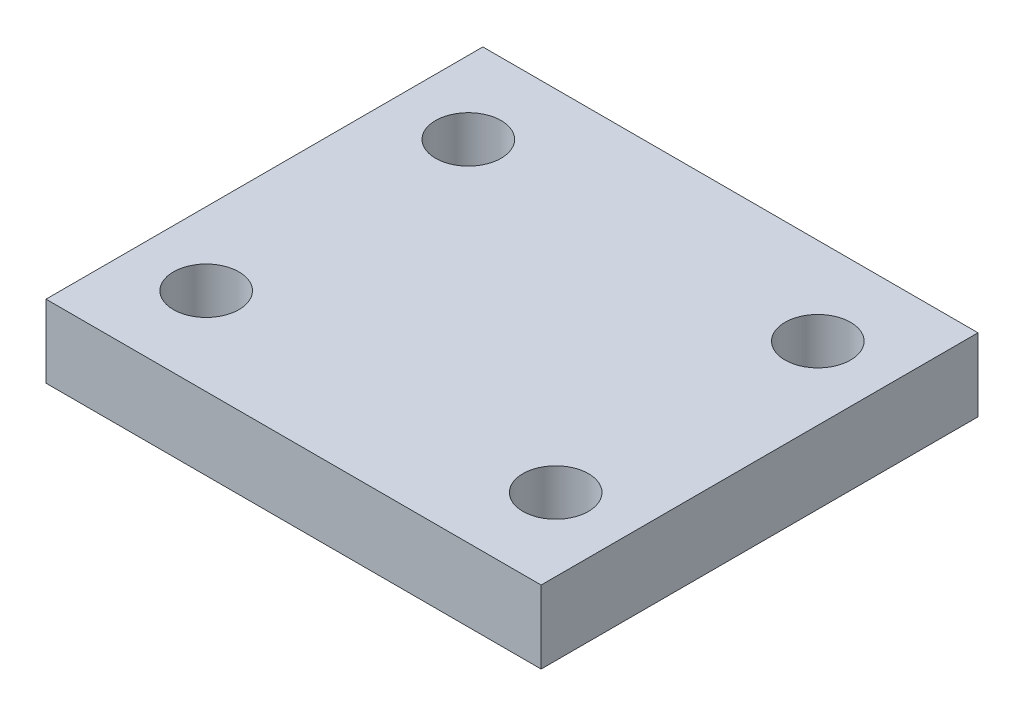
ISO-10303-21;
HEADER;
FILE_DESCRIPTION(('STEP AP214'),'2;1');
FILE_NAME('part.step','',(''),(''),'','','');
FILE_SCHEMA(('AUTOMOTIVE_DESIGN { 1 0 10303 214 1 1 1 1 }'));
ENDSEC;
DATA;
#1=APPLICATION_CONTEXT('core data for automotive mechanical design processes');
#2=APPLICATION_PROTOCOL_DEFINITION('international standard','automotive_design',2000,#1);
#3=PRODUCT_CONTEXT('',#1,'mechanical');
#4=PRODUCT('Part','Part','',(#3));
#5=PRODUCT_RELATED_PRODUCT_CATEGORY('part','',(#4));
#6=PRODUCT_DEFINITION_FORMATION('','',#4);
#7=PRODUCT_DEFINITION_CONTEXT('part definition',#1,'design');
#8=PRODUCT_DEFINITION('design','',#6,#7);
#9=PRODUCT_DEFINITION_SHAPE('','',#8);
#10=(LENGTH_UNIT() NAMED_UNIT(*) SI_UNIT(.MILLI.,.METRE.));
#11=(NAMED_UNIT(*) PLANE_ANGLE_UNIT() SI_UNIT($,.RADIAN.));
#12=(NAMED_UNIT(*) SI_UNIT($,.STERADIAN.) SOLID_ANGLE_UNIT());
#13=UNCERTAINTY_MEASURE_WITH_UNIT(LENGTH_MEASURE(1.E-05),#10,'distance_accuracy_value','');
#14=(GEOMETRIC_REPRESENTATION_CONTEXT(3) GLOBAL_UNCERTAINTY_ASSIGNED_CONTEXT((#13)) GLOBAL_UNIT_ASSIGNED_CONTEXT((#10,
#11,#12)) REPRESENTATION_CONTEXT('',''));
#15=CARTESIAN_POINT('',(0.,0.,0.));
#16=DIRECTION('',(0.,0.,1.));
#17=DIRECTION('',(1.,0.,0.));
#18=AXIS2_PLACEMENT_3D('',#15,#16,#17);
#19=CARTESIAN_POINT('',(0.,5.,0.));
#20=DIRECTION('',(0.,-1.,0.));
#21=DIRECTION('',(0.,0.,-1.));
#22=AXIS2_PLACEMENT_3D('',#19,#20,#21);
#23=PLANE('',#22);
#24=CARTESIAN_POINT('',(29.,5.,-24.));
#25=DIRECTION('',(0.,1.,0.));
#26=DIRECTION('',(0.,0.,1.));
#27=AXIS2_PLACEMENT_3D('',#24,#25,#26);
#28=CIRCLE('',#27,2.25);
#29=CARTESIAN_POINT('',(29.,5.,-21.75));
#30=VERTEX_POINT('',#29);
#31=EDGE_CURVE('E121',#30,#30,#28,.T.);
#32=ORIENTED_EDGE('',*,*,#31,.F.);
#33=EDGE_LOOP('',(#32));
#34=FACE_BOUND('',#33,.T.);
#35=CARTESIAN_POINT('',(5.,5.,-6.));
#36=DIRECTION('',(0.,1.,0.));
#37=DIRECTION('',(0.,0.,1.));
#38=AXIS2_PLACEMENT_3D('',#35,#36,#37);
#39=CIRCLE('',#38,2.25);
#40=CARTESIAN_POINT('',(5.,5.,-3.75));
#41=VERTEX_POINT('',#40);
#42=EDGE_CURVE('E100',#41,#41,#39,.T.);
#43=ORIENTED_EDGE('',*,*,#42,.F.);
#44=EDGE_LOOP('',(#43));
#45=FACE_BOUND('',#44,.T.);
#46=DIRECTION('',(0.,0.,1.));
#47=VECTOR('',#46,1.);
#48=CARTESIAN_POINT('',(0.,5.,0.));
#49=LINE('',#48,#47);
#50=CARTESIAN_POINT('',(0.,5.,-30.));
#51=VERTEX_POINT('',#50);
#52=CARTESIAN_POINT('',(0.,5.,0.));
#53=VERTEX_POINT('',#52);
#54=EDGE_CURVE('E85',#51,#53,#49,.T.);
#55=ORIENTED_EDGE('',*,*,#54,.T.);
#56=DIRECTION('',(1.,0.,0.));
#57=VECTOR('',#56,1.);
#58=CARTESIAN_POINT('',(0.,5.,0.));
#59=LINE('',#58,#57);
#60=CARTESIAN_POINT('',(34.,5.,0.));
#61=VERTEX_POINT('',#60);
#62=EDGE_CURVE('E80',#53,#61,#59,.T.);
#63=ORIENTED_EDGE('',*,*,#62,.T.);
#64=DIRECTION('',(0.,0.,-1.));
#65=VECTOR('',#64,1.);
#66=CARTESIAN_POINT('',(34.,5.,0.));
#67=LINE('',#66,#65);
#68=CARTESIAN_POINT('',(34.,5.,-30.));
#69=VERTEX_POINT('',#68);
#70=EDGE_CURVE('E83',#61,#69,#67,.T.);
#71=ORIENTED_EDGE('',*,*,#70,.T.);
#72=DIRECTION('',(-1.,0.,0.));
#73=VECTOR('',#72,1.);
#74=CARTESIAN_POINT('',(0.,5.,-30.));
#75=LINE('',#74,#73);
#76=EDGE_CURVE('E50',#69,#51,#75,.T.);
#77=ORIENTED_EDGE('',*,*,#76,.T.);
#78=EDGE_LOOP('',(#55,#63,#71,#77));
#79=FACE_BOUND('',#78,.T.);
#80=CARTESIAN_POINT('',(29.,5.,-6.));
#81=DIRECTION('',(0.,1.,0.));
#82=DIRECTION('',(0.,0.,1.));
#83=AXIS2_PLACEMENT_3D('',#80,#81,#82);
#84=CIRCLE('',#83,2.25);
#85=CARTESIAN_POINT('',(29.,5.,-3.75));
#86=VERTEX_POINT('',#85);
#87=EDGE_CURVE('E115',#86,#86,#84,.T.);
#88=ORIENTED_EDGE('',*,*,#87,.F.);
#89=EDGE_LOOP('',(#88));
#90=FACE_BOUND('',#89,.T.);
#91=CARTESIAN_POINT('',(5.,5.,-24.));
#92=DIRECTION('',(0.,1.,0.));
#93=DIRECTION('',(0.,0.,1.));
#94=AXIS2_PLACEMENT_3D('',#91,#92,#93);
#95=CIRCLE('',#94,2.25);
#96=CARTESIAN_POINT('',(5.,5.,-21.75));
#97=VERTEX_POINT('',#96);
#98=EDGE_CURVE('E127',#97,#97,#95,.T.);
#99=ORIENTED_EDGE('',*,*,#98,.F.);
#100=EDGE_LOOP('',(#99));
#101=FACE_BOUND('',#100,.T.);
#102=ADVANCED_FACE('F33',(#34,#45,#79,#90,#101),#23,.F.);
#103=CARTESIAN_POINT('',(0.,0.,0.));
#104=DIRECTION('',(0.,-1.,0.));
#105=DIRECTION('',(0.,0.,-1.));
#106=AXIS2_PLACEMENT_3D('',#103,#104,#105);
#107=PLANE('',#106);
#108=CARTESIAN_POINT('',(29.,0.,-24.));
#109=DIRECTION('',(0.,1.,0.));
#110=DIRECTION('',(0.,0.,1.));
#111=AXIS2_PLACEMENT_3D('',#108,#109,#110);
#112=CIRCLE('',#111,2.25);
#113=CARTESIAN_POINT('',(29.,0.,-21.75));
#114=VERTEX_POINT('',#113);
#115=EDGE_CURVE('E124',#114,#114,#112,.T.);
#116=ORIENTED_EDGE('',*,*,#115,.T.);
#117=EDGE_LOOP('',(#116));
#118=FACE_BOUND('',#117,.T.);
#119=CARTESIAN_POINT('',(5.,0.,-6.));
#120=DIRECTION('',(0.,1.,0.));
#121=DIRECTION('',(0.,0.,1.));
#122=AXIS2_PLACEMENT_3D('',#119,#120,#121);
#123=CIRCLE('',#122,2.25);
#124=CARTESIAN_POINT('',(5.,0.,-3.75));
#125=VERTEX_POINT('',#124);
#126=EDGE_CURVE('E112',#125,#125,#123,.T.);
#127=ORIENTED_EDGE('',*,*,#126,.T.);
#128=EDGE_LOOP('',(#127));
#129=FACE_BOUND('',#128,.T.);
#130=DIRECTION('',(0.,0.,1.));
#131=VECTOR('',#130,1.);
#132=CARTESIAN_POINT('',(0.,0.,0.));
#133=LINE('',#132,#131);
#134=CARTESIAN_POINT('',(0.,0.,-30.));
#135=VERTEX_POINT('',#134);
#136=CARTESIAN_POINT('',(0.,0.,0.));
#137=VERTEX_POINT('',#136);
#138=EDGE_CURVE('E97',#135,#137,#133,.T.);
#139=ORIENTED_EDGE('',*,*,#138,.F.);
#140=DIRECTION('',(-1.,0.,0.));
#141=VECTOR('',#140,1.);
#142=CARTESIAN_POINT('',(0.,0.,-30.));
#143=LINE('',#142,#141);
#144=CARTESIAN_POINT('',(34.,0.,-30.));
#145=VERTEX_POINT('',#144);
#146=EDGE_CURVE('E73',#145,#135,#143,.T.);
#147=ORIENTED_EDGE('',*,*,#146,.F.);
#148=DIRECTION('',(0.,0.,-1.));
#149=VECTOR('',#148,1.);
#150=CARTESIAN_POINT('',(34.,0.,0.));
#151=LINE('',#150,#149);
#152=CARTESIAN_POINT('',(34.,0.,0.));
#153=VERTEX_POINT('',#152);
#154=EDGE_CURVE('E67',#153,#145,#151,.T.);
#155=ORIENTED_EDGE('',*,*,#154,.F.);
#156=DIRECTION('',(1.,0.,0.));
#157=VECTOR('',#156,1.);
#158=CARTESIAN_POINT('',(0.,0.,0.));
#159=LINE('',#158,#157);
#160=EDGE_CURVE('E89',#137,#153,#159,.T.);
#161=ORIENTED_EDGE('',*,*,#160,.F.);
#162=EDGE_LOOP('',(#139,#147,#155,#161));
#163=FACE_BOUND('',#162,.T.);
#164=CARTESIAN_POINT('',(29.,0.,-6.));
#165=DIRECTION('',(0.,1.,0.));
#166=DIRECTION('',(0.,0.,1.));
#167=AXIS2_PLACEMENT_3D('',#164,#165,#166);
#168=CIRCLE('',#167,2.25);
#169=CARTESIAN_POINT('',(29.,0.,-3.75));
#170=VERTEX_POINT('',#169);
#171=EDGE_CURVE('E118',#170,#170,#168,.T.);
#172=ORIENTED_EDGE('',*,*,#171,.T.);
#173=EDGE_LOOP('',(#172));
#174=FACE_BOUND('',#173,.T.);
#175=CARTESIAN_POINT('',(5.,0.,-24.));
#176=DIRECTION('',(0.,1.,0.));
#177=DIRECTION('',(0.,0.,1.));
#178=AXIS2_PLACEMENT_3D('',#175,#176,#177);
#179=CIRCLE('',#178,2.25);
#180=CARTESIAN_POINT('',(5.,0.,-21.75));
#181=VERTEX_POINT('',#180);
#182=EDGE_CURVE('E130',#181,#181,#179,.T.);
#183=ORIENTED_EDGE('',*,*,#182,.T.);
#184=EDGE_LOOP('',(#183));
#185=FACE_BOUND('',#184,.T.);
#186=ADVANCED_FACE('F108',(#118,#129,#163,#174,#185),#107,.T.);
#187=CARTESIAN_POINT('',(0.,5.,0.));
#188=DIRECTION('',(1.,0.,0.));
#189=DIRECTION('',(0.,0.,-1.));
#190=AXIS2_PLACEMENT_3D('',#187,#188,#189);
#191=PLANE('',#190);
#192=ORIENTED_EDGE('',*,*,#138,.T.);
#193=DIRECTION('',(0.,-1.,0.));
#194=VECTOR('',#193,1.);
#195=CARTESIAN_POINT('',(0.,5.,0.));
#196=LINE('',#195,#194);
#197=EDGE_CURVE('E11',#53,#137,#196,.T.);
#198=ORIENTED_EDGE('',*,*,#197,.F.);
#199=ORIENTED_EDGE('',*,*,#54,.F.);
#200=DIRECTION('',(0.,-1.,0.));
#201=VECTOR('',#200,1.);
#202=CARTESIAN_POINT('',(0.,5.,-30.));
#203=LINE('',#202,#201);
#204=EDGE_CURVE('E93',#51,#135,#203,.T.);
#205=ORIENTED_EDGE('',*,*,#204,.T.);
#206=EDGE_LOOP('',(#192,#198,#199,#205));
#207=FACE_BOUND('',#206,.T.);
#208=ADVANCED_FACE('F35',(#207),#191,.F.);
#209=CARTESIAN_POINT('',(0.,5.,0.));
#210=DIRECTION('',(0.,0.,-1.));
#211=DIRECTION('',(-1.,0.,0.));
#212=AXIS2_PLACEMENT_3D('',#209,#210,#211);
#213=PLANE('',#212);
#214=ORIENTED_EDGE('',*,*,#160,.T.);
#215=DIRECTION('',(0.,-1.,0.));
#216=VECTOR('',#215,1.);
#217=CARTESIAN_POINT('',(34.,5.,0.));
#218=LINE('',#217,#216);
#219=EDGE_CURVE('E42',#61,#153,#218,.T.);
#220=ORIENTED_EDGE('',*,*,#219,.F.);
#221=ORIENTED_EDGE('',*,*,#62,.F.);
#222=ORIENTED_EDGE('',*,*,#197,.T.);
#223=EDGE_LOOP('',(#214,#220,#221,#222));
#224=FACE_BOUND('',#223,.T.);
#225=ADVANCED_FACE('F88',(#224),#213,.F.);
#226=CARTESIAN_POINT('',(34.,5.,0.));
#227=DIRECTION('',(-1.,0.,0.));
#228=DIRECTION('',(0.,0.,1.));
#229=AXIS2_PLACEMENT_3D('',#226,#227,#228);
#230=PLANE('',#229);
#231=ORIENTED_EDGE('',*,*,#154,.T.);
#232=DIRECTION('',(0.,-1.,0.));
#233=VECTOR('',#232,1.);
#234=CARTESIAN_POINT('',(34.,5.,-30.));
#235=LINE('',#234,#233);
#236=EDGE_CURVE('E90',#69,#145,#235,.T.);
#237=ORIENTED_EDGE('',*,*,#236,.F.);
#238=ORIENTED_EDGE('',*,*,#70,.F.);
#239=ORIENTED_EDGE('',*,*,#219,.T.);
#240=EDGE_LOOP('',(#231,#237,#238,#239));
#241=FACE_BOUND('',#240,.T.);
#242=ADVANCED_FACE('F91',(#241),#230,.F.);
#243=CARTESIAN_POINT('',(0.,5.,-30.));
#244=DIRECTION('',(0.,0.,1.));
#245=DIRECTION('',(1.,0.,0.));
#246=AXIS2_PLACEMENT_3D('',#243,#244,#245);
#247=PLANE('',#246);
#248=ORIENTED_EDGE('',*,*,#146,.T.);
#249=ORIENTED_EDGE('',*,*,#204,.F.);
#250=ORIENTED_EDGE('',*,*,#76,.F.);
#251=ORIENTED_EDGE('',*,*,#236,.T.);
#252=EDGE_LOOP('',(#248,#249,#250,#251));
#253=FACE_BOUND('',#252,.T.);
#254=ADVANCED_FACE('F105',(#253),#247,.F.);
#255=CARTESIAN_POINT('',(5.,5.,-6.));
#256=DIRECTION('',(0.,-1.,0.));
#257=DIRECTION('',(0.,0.,-1.));
#258=AXIS2_PLACEMENT_3D('',#255,#256,#257);
#259=CYLINDRICAL_SURFACE('',#258,2.25);
#260=ORIENTED_EDGE('',*,*,#42,.T.);
#261=EDGE_LOOP('',(#260));
#262=FACE_BOUND('',#261,.T.);
#263=ORIENTED_EDGE('',*,*,#126,.F.);
#264=EDGE_LOOP('',(#263));
#265=FACE_BOUND('',#264,.T.);
#266=ADVANCED_FACE('F150',(#262,#265),#259,.F.);
#267=CARTESIAN_POINT('',(29.,5.,-6.));
#268=DIRECTION('',(0.,-1.,0.));
#269=DIRECTION('',(0.,0.,-1.));
#270=AXIS2_PLACEMENT_3D('',#267,#268,#269);
#271=CYLINDRICAL_SURFACE('',#270,2.25);
#272=ORIENTED_EDGE('',*,*,#87,.T.);
#273=EDGE_LOOP('',(#272));
#274=FACE_BOUND('',#273,.T.);
#275=ORIENTED_EDGE('',*,*,#171,.F.);
#276=EDGE_LOOP('',(#275));
#277=FACE_BOUND('',#276,.T.);
#278=ADVANCED_FACE('F196',(#274,#277),#271,.F.);
#279=CARTESIAN_POINT('',(29.,5.,-24.));
#280=DIRECTION('',(0.,-1.,0.));
#281=DIRECTION('',(0.,0.,-1.));
#282=AXIS2_PLACEMENT_3D('',#279,#280,#281);
#283=CYLINDRICAL_SURFACE('',#282,2.25);
#284=ORIENTED_EDGE('',*,*,#31,.T.);
#285=EDGE_LOOP('',(#284));
#286=FACE_BOUND('',#285,.T.);
#287=ORIENTED_EDGE('',*,*,#115,.F.);
#288=EDGE_LOOP('',(#287));
#289=FACE_BOUND('',#288,.T.);
#290=ADVANCED_FACE('F204',(#286,#289),#283,.F.);
#291=CARTESIAN_POINT('',(5.,5.,-24.));
#292=DIRECTION('',(0.,-1.,0.));
#293=DIRECTION('',(0.,0.,-1.));
#294=AXIS2_PLACEMENT_3D('',#291,#292,#293);
#295=CYLINDRICAL_SURFACE('',#294,2.25);
#296=ORIENTED_EDGE('',*,*,#98,.T.);
#297=EDGE_LOOP('',(#296));
#298=FACE_BOUND('',#297,.T.);
#299=ORIENTED_EDGE('',*,*,#182,.F.);
#300=EDGE_LOOP('',(#299));
#301=FACE_BOUND('',#300,.T.);
#302=ADVANCED_FACE('F136',(#298,#301),#295,.F.);
#303=CLOSED_SHELL('',(#102,#186,#208,#225,#242,#254,#266,#278,#290,#302));
#304=MANIFOLD_SOLID_BREP('B2',#303);
#305=ADVANCED_BREP_SHAPE_REPRESENTATION('',(#18,#304),#14);
#306=SHAPE_DEFINITION_REPRESENTATION(#9,#305);
ENDSEC;
END-ISO-10303-21;
